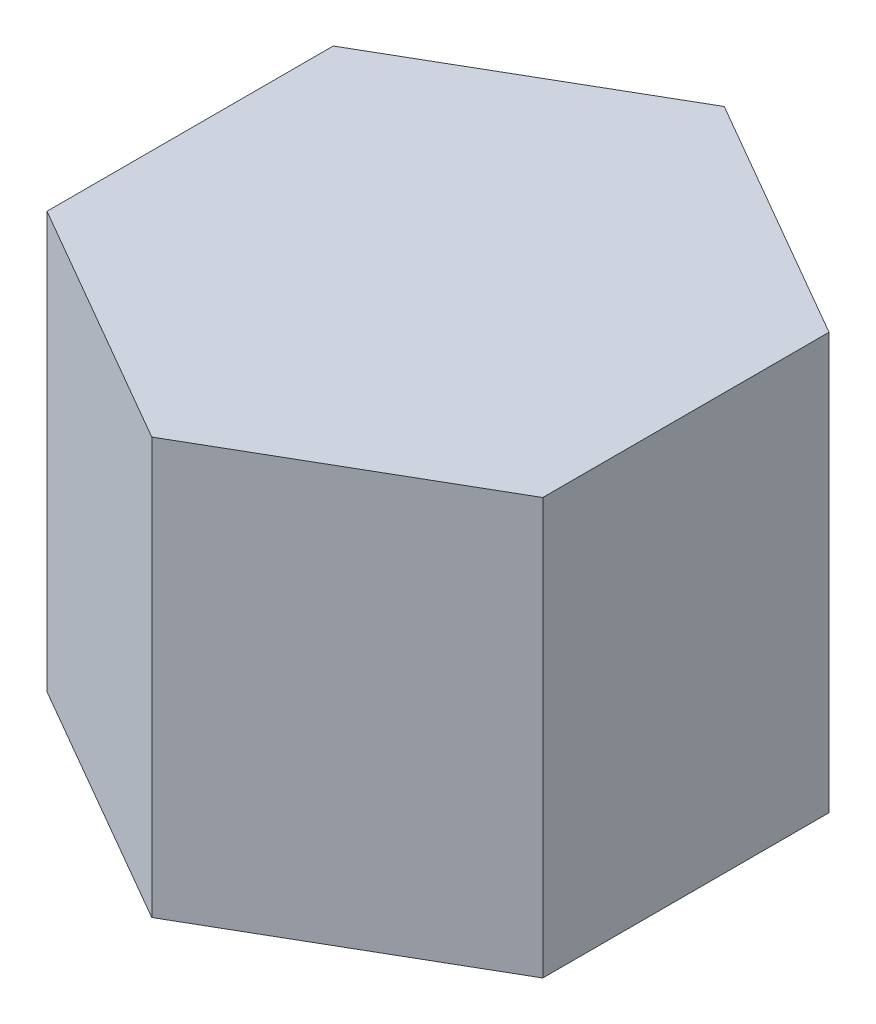
ISO-10303-21;
HEADER;
FILE_DESCRIPTION(('STEP AP214'),'2;1');
FILE_NAME('part.step','',(''),(''),'','','');
FILE_SCHEMA(('AUTOMOTIVE_DESIGN { 1 0 10303 214 1 1 1 1 }'));
ENDSEC;
DATA;
#1=APPLICATION_CONTEXT('core data for automotive mechanical design processes');
#2=APPLICATION_PROTOCOL_DEFINITION('international standard','automotive_design',2000,#1);
#3=PRODUCT_CONTEXT('',#1,'mechanical');
#4=PRODUCT('Part','Part','',(#3));
#5=PRODUCT_RELATED_PRODUCT_CATEGORY('part','',(#4));
#6=PRODUCT_DEFINITION_FORMATION('','',#4);
#7=PRODUCT_DEFINITION_CONTEXT('part definition',#1,'design');
#8=PRODUCT_DEFINITION('design','',#6,#7);
#9=PRODUCT_DEFINITION_SHAPE('','',#8);
#10=(LENGTH_UNIT() NAMED_UNIT(*) SI_UNIT(.MILLI.,.METRE.));
#11=(NAMED_UNIT(*) PLANE_ANGLE_UNIT() SI_UNIT($,.RADIAN.));
#12=(NAMED_UNIT(*) SI_UNIT($,.STERADIAN.) SOLID_ANGLE_UNIT());
#13=UNCERTAINTY_MEASURE_WITH_UNIT(LENGTH_MEASURE(1.E-05),#10,'distance_accuracy_value','');
#14=(GEOMETRIC_REPRESENTATION_CONTEXT(3) GLOBAL_UNCERTAINTY_ASSIGNED_CONTEXT((#13)) GLOBAL_UNIT_ASSIGNED_CONTEXT((#10,
#11,#12)) REPRESENTATION_CONTEXT('',''));
#15=CARTESIAN_POINT('',(0.,0.,0.));
#16=DIRECTION('',(0.,0.,1.));
#17=DIRECTION('',(1.,0.,0.));
#18=AXIS2_PLACEMENT_3D('',#15,#16,#17);
#19=CARTESIAN_POINT('',(210.839551417382,-147.556598747966,287.351844201572));
#20=DIRECTION('',(-0.499999999999978,0.,-0.866025403784452));
#21=DIRECTION('',(-0.866025403784452,0.,0.499999999999978));
#22=AXIS2_PLACEMENT_3D('',#19,#20,#21);
#23=PLANE('',#22);
#24=CARTESIAN_POINT('',(211.142660308706,-147.047793579175,287.176844201572));
#25=DIRECTION('',(-0.866025403784452,0.,0.499999999999978));
#26=VECTOR('',#25,1.);
#27=LINE('',#24,#26);
#28=CARTESIAN_POINT('',(211.142660308706,-147.047793579175,287.176844201572));
#29=VERTEX_POINT('',#28);
#30=CARTESIAN_POINT('',(210.839551417382,-147.047793579175,287.351844201572));
#31=VERTEX_POINT('',#30);
#32=EDGE_CURVE('E170',#29,#31,#27,.T.);
#33=ORIENTED_EDGE('',*,*,#32,.T.);
#34=CARTESIAN_POINT('',(210.839551417382,-147.556598747966,287.351844201572));
#35=DIRECTION('',(0.,1.,0.));
#36=VECTOR('',#35,1.);
#37=LINE('',#34,#36);
#38=CARTESIAN_POINT('',(210.839551417382,-147.556598747966,287.351844201572));
#39=VERTEX_POINT('',#38);
#40=EDGE_CURVE('E35',#39,#31,#37,.T.);
#41=ORIENTED_EDGE('',*,*,#40,.F.);
#42=CARTESIAN_POINT('',(211.142660308706,-147.556598747966,287.176844201572));
#43=DIRECTION('',(-0.866025403784452,0.,0.499999999999978));
#44=VECTOR('',#43,1.);
#45=LINE('',#42,#44);
#46=CARTESIAN_POINT('',(211.142660308706,-147.556598747966,287.176844201572));
#47=VERTEX_POINT('',#46);
#48=EDGE_CURVE('E159',#47,#39,#45,.T.);
#49=ORIENTED_EDGE('',*,*,#48,.F.);
#50=CARTESIAN_POINT('',(211.142660308706,-147.556598747966,287.176844201572));
#51=DIRECTION('',(0.,1.,0.));
#52=VECTOR('',#51,1.);
#53=LINE('',#50,#52);
#54=EDGE_CURVE('E10',#47,#29,#53,.T.);
#55=ORIENTED_EDGE('',*,*,#54,.T.);
#56=EDGE_LOOP('',(#33,#41,#49,#55));
#57=FACE_BOUND('',#56,.T.);
#58=ADVANCED_FACE('F16',(#57),#23,.F.);
#59=CARTESIAN_POINT('',(211.142660308706,-147.556598747966,291.594471220494));
#60=DIRECTION('',(-1.,0.,0.));
#61=DIRECTION('',(0.,-1.,0.));
#62=AXIS2_PLACEMENT_3D('',#59,#60,#61);
#63=PLANE('',#62);
#64=CARTESIAN_POINT('',(211.142660308706,-147.047793579175,286.826844201572));
#65=DIRECTION('',(0.,0.,1.));
#66=VECTOR('',#65,1.);
#67=LINE('',#64,#66);
#68=CARTESIAN_POINT('',(211.142660308706,-147.047793579175,286.826844201572));
#69=VERTEX_POINT('',#68);
#70=EDGE_CURVE('E167',#69,#29,#67,.T.);
#71=ORIENTED_EDGE('',*,*,#70,.T.);
#72=ORIENTED_EDGE('',*,*,#54,.F.);
#73=CARTESIAN_POINT('',(211.142660308706,-147.556598747966,286.826844201572));
#74=DIRECTION('',(0.,0.,1.));
#75=VECTOR('',#74,1.);
#76=LINE('',#73,#75);
#77=CARTESIAN_POINT('',(211.142660308706,-147.556598747966,286.826844201572));
#78=VERTEX_POINT('',#77);
#79=EDGE_CURVE('E156',#78,#47,#76,.T.);
#80=ORIENTED_EDGE('',*,*,#79,.F.);
#81=CARTESIAN_POINT('',(211.142660308706,-147.556598747966,286.826844201572));
#82=DIRECTION('',(0.,1.,0.));
#83=VECTOR('',#82,1.);
#84=LINE('',#81,#83);
#85=EDGE_CURVE('E27',#78,#69,#84,.T.);
#86=ORIENTED_EDGE('',*,*,#85,.T.);
#87=EDGE_LOOP('',(#71,#72,#80,#86));
#88=FACE_BOUND('',#87,.T.);
#89=ADVANCED_FACE('F189',(#88),#63,.F.);
#90=CARTESIAN_POINT('',(211.142660308706,-147.556598747966,286.826844201572));
#91=DIRECTION('',(-0.499999999999943,0.,0.866025403784471));
#92=DIRECTION('',(0.866025403784471,0.,0.499999999999943));
#93=AXIS2_PLACEMENT_3D('',#90,#91,#92);
#94=PLANE('',#93);
#95=CARTESIAN_POINT('',(210.839551417382,-147.047793579175,286.651844201572));
#96=DIRECTION('',(0.866025403784471,0.,0.499999999999943));
#97=VECTOR('',#96,1.);
#98=LINE('',#95,#97);
#99=CARTESIAN_POINT('',(210.839551417382,-147.047793579175,286.651844201572));
#100=VERTEX_POINT('',#99);
#101=EDGE_CURVE('E163',#100,#69,#98,.T.);
#102=ORIENTED_EDGE('',*,*,#101,.T.);
#103=ORIENTED_EDGE('',*,*,#85,.F.);
#104=CARTESIAN_POINT('',(210.839551417382,-147.556598747966,286.651844201572));
#105=DIRECTION('',(0.866025403784471,0.,0.499999999999943));
#106=VECTOR('',#105,1.);
#107=LINE('',#104,#106);
#108=CARTESIAN_POINT('',(210.839551417382,-147.556598747966,286.651844201572));
#109=VERTEX_POINT('',#108);
#110=EDGE_CURVE('E106',#109,#78,#107,.T.);
#111=ORIENTED_EDGE('',*,*,#110,.F.);
#112=CARTESIAN_POINT('',(210.839551417382,-147.556598747966,286.651844201572));
#113=DIRECTION('',(0.,1.,0.));
#114=VECTOR('',#113,1.);
#115=LINE('',#112,#114);
#116=EDGE_CURVE('E94',#109,#100,#115,.T.);
#117=ORIENTED_EDGE('',*,*,#116,.T.);
#118=EDGE_LOOP('',(#102,#103,#111,#117));
#119=FACE_BOUND('',#118,.T.);
#120=ADVANCED_FACE('F198',(#119),#94,.F.);
#121=CARTESIAN_POINT('',(210.839551417382,-147.556598747966,286.651844201572));
#122=DIRECTION('',(0.499999999999978,0.,0.866025403784452));
#123=DIRECTION('',(0.866025403784452,0.,-0.499999999999978));
#124=AXIS2_PLACEMENT_3D('',#121,#122,#123);
#125=PLANE('',#124);
#126=CARTESIAN_POINT('',(210.536442526057,-147.047793579175,286.826844201572));
#127=DIRECTION('',(0.866025403784452,0.,-0.499999999999978));
#128=VECTOR('',#127,1.);
#129=LINE('',#126,#128);
#130=CARTESIAN_POINT('',(210.536442526057,-147.047793579175,286.826844201572));
#131=VERTEX_POINT('',#130);
#132=EDGE_CURVE('E162',#131,#100,#129,.T.);
#133=ORIENTED_EDGE('',*,*,#132,.T.);
#134=ORIENTED_EDGE('',*,*,#116,.F.);
#135=CARTESIAN_POINT('',(210.536442526057,-147.556598747966,286.826844201572));
#136=DIRECTION('',(0.866025403784452,0.,-0.499999999999978));
#137=VECTOR('',#136,1.);
#138=LINE('',#135,#137);
#139=CARTESIAN_POINT('',(210.536442526057,-147.556598747966,286.826844201572));
#140=VERTEX_POINT('',#139);
#141=EDGE_CURVE('E98',#140,#109,#138,.T.);
#142=ORIENTED_EDGE('',*,*,#141,.F.);
#143=CARTESIAN_POINT('',(210.536442526057,-147.556598747966,286.826844201572));
#144=DIRECTION('',(0.,1.,0.));
#145=VECTOR('',#144,1.);
#146=LINE('',#143,#145);
#147=EDGE_CURVE('E79',#140,#131,#146,.T.);
#148=ORIENTED_EDGE('',*,*,#147,.T.);
#149=EDGE_LOOP('',(#133,#134,#142,#148));
#150=FACE_BOUND('',#149,.T.);
#151=ADVANCED_FACE('F100',(#150),#125,.F.);
#152=CARTESIAN_POINT('',(210.536442526057,-147.556598747966,291.594471220494));
#153=DIRECTION('',(1.,0.,0.));
#154=DIRECTION('',(0.,1.,0.));
#155=AXIS2_PLACEMENT_3D('',#152,#153,#154);
#156=PLANE('',#155);
#157=CARTESIAN_POINT('',(210.536442526057,-147.047793579175,287.176844201572));
#158=DIRECTION('',(0.,0.,-1.));
#159=VECTOR('',#158,1.);
#160=LINE('',#157,#159);
#161=CARTESIAN_POINT('',(210.536442526057,-147.047793579175,287.176844201572));
#162=VERTEX_POINT('',#161);
#163=EDGE_CURVE('E88',#162,#131,#160,.T.);
#164=ORIENTED_EDGE('',*,*,#163,.T.);
#165=ORIENTED_EDGE('',*,*,#147,.F.);
#166=CARTESIAN_POINT('',(210.536442526057,-147.556598747966,287.176844201572));
#167=DIRECTION('',(0.,0.,-1.));
#168=VECTOR('',#167,1.);
#169=LINE('',#166,#168);
#170=CARTESIAN_POINT('',(210.536442526057,-147.556598747966,287.176844201572));
#171=VERTEX_POINT('',#170);
#172=EDGE_CURVE('E84',#171,#140,#169,.T.);
#173=ORIENTED_EDGE('',*,*,#172,.F.);
#174=CARTESIAN_POINT('',(210.536442526057,-147.556598747966,287.176844201572));
#175=DIRECTION('',(0.,1.,0.));
#176=VECTOR('',#175,1.);
#177=LINE('',#174,#176);
#178=EDGE_CURVE('E58',#171,#162,#177,.T.);
#179=ORIENTED_EDGE('',*,*,#178,.T.);
#180=EDGE_LOOP('',(#164,#165,#173,#179));
#181=FACE_BOUND('',#180,.T.);
#182=ADVANCED_FACE('F82',(#181),#156,.F.);
#183=CARTESIAN_POINT('',(210.536442526057,-147.556598747966,287.176844201572));
#184=DIRECTION('',(0.499999999999943,0.,-0.866025403784471));
#185=DIRECTION('',(-0.866025403784471,0.,-0.499999999999943));
#186=AXIS2_PLACEMENT_3D('',#183,#184,#185);
#187=PLANE('',#186);
#188=CARTESIAN_POINT('',(210.839551417382,-147.047793579175,287.351844201572));
#189=DIRECTION('',(-0.866025403784471,0.,-0.499999999999943));
#190=VECTOR('',#189,1.);
#191=LINE('',#188,#190);
#192=EDGE_CURVE('E160',#31,#162,#191,.T.);
#193=ORIENTED_EDGE('',*,*,#192,.T.);
#194=ORIENTED_EDGE('',*,*,#178,.F.);
#195=CARTESIAN_POINT('',(210.839551417382,-147.556598747966,287.351844201572));
#196=DIRECTION('',(-0.866025403784471,0.,-0.499999999999943));
#197=VECTOR('',#196,1.);
#198=LINE('',#195,#197);
#199=EDGE_CURVE('E112',#39,#171,#198,.T.);
#200=ORIENTED_EDGE('',*,*,#199,.F.);
#201=ORIENTED_EDGE('',*,*,#40,.T.);
#202=EDGE_LOOP('',(#193,#194,#200,#201));
#203=FACE_BOUND('',#202,.T.);
#204=ADVANCED_FACE('F131',(#203),#187,.F.);
#205=CARTESIAN_POINT('',(206.491105863044,-147.556598747966,291.594471220494));
#206=DIRECTION('',(0.,1.,0.));
#207=DIRECTION('',(-1.,0.,0.));
#208=AXIS2_PLACEMENT_3D('',#205,#206,#207);
#209=PLANE('',#208);
#210=ORIENTED_EDGE('',*,*,#48,.T.);
#211=ORIENTED_EDGE('',*,*,#199,.T.);
#212=ORIENTED_EDGE('',*,*,#172,.T.);
#213=ORIENTED_EDGE('',*,*,#141,.T.);
#214=ORIENTED_EDGE('',*,*,#110,.T.);
#215=ORIENTED_EDGE('',*,*,#79,.T.);
#216=EDGE_LOOP('',(#210,#211,#212,#213,#214,#215));
#217=FACE_BOUND('',#216,.T.);
#218=ADVANCED_FACE('F111',(#217),#209,.F.);
#219=CARTESIAN_POINT('',(206.491105863044,-147.047793579175,291.594471220494));
#220=DIRECTION('',(0.,1.,0.));
#221=DIRECTION('',(-1.,0.,0.));
#222=AXIS2_PLACEMENT_3D('',#219,#220,#221);
#223=PLANE('',#222);
#224=ORIENTED_EDGE('',*,*,#32,.F.);
#225=ORIENTED_EDGE('',*,*,#70,.F.);
#226=ORIENTED_EDGE('',*,*,#101,.F.);
#227=ORIENTED_EDGE('',*,*,#132,.F.);
#228=ORIENTED_EDGE('',*,*,#163,.F.);
#229=ORIENTED_EDGE('',*,*,#192,.F.);
#230=EDGE_LOOP('',(#224,#225,#226,#227,#228,#229));
#231=FACE_BOUND('',#230,.T.);
#232=ADVANCED_FACE('F130',(#231),#223,.T.);
#233=CLOSED_SHELL('',(#58,#89,#120,#151,#182,#204,#218,#232));
#234=MANIFOLD_SOLID_BREP('B1',#233);
#235=ADVANCED_BREP_SHAPE_REPRESENTATION('',(#18,#234),#14);
#236=SHAPE_DEFINITION_REPRESENTATION(#9,#235);
ENDSEC;
END-ISO-10303-21;
